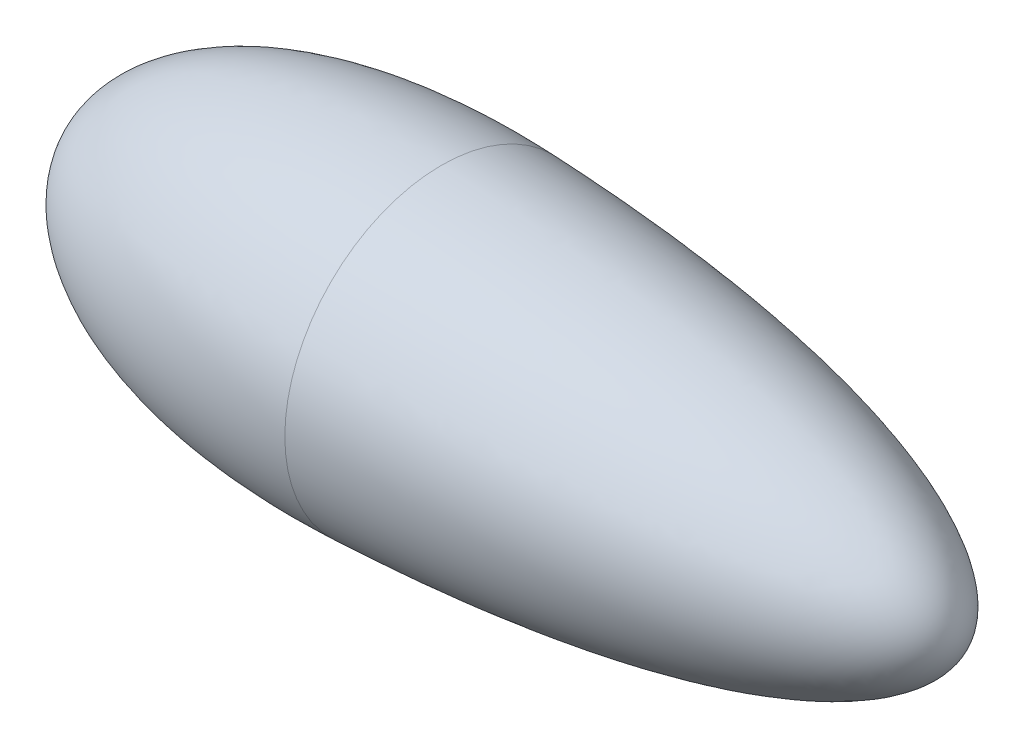
ISO-10303-21;
HEADER;
FILE_DESCRIPTION(('STEP AP214'),'2;1');
FILE_NAME('part.step','',(''),(''),'','','');
FILE_SCHEMA(('AUTOMOTIVE_DESIGN { 1 0 10303 214 1 1 1 1 }'));
ENDSEC;
DATA;
#1=APPLICATION_CONTEXT('core data for automotive mechanical design processes');
#2=APPLICATION_PROTOCOL_DEFINITION('international standard','automotive_design',2000,#1);
#3=PRODUCT_CONTEXT('',#1,'mechanical');
#4=PRODUCT('Part','Part','',(#3));
#5=PRODUCT_RELATED_PRODUCT_CATEGORY('part','',(#4));
#6=PRODUCT_DEFINITION_FORMATION('','',#4);
#7=PRODUCT_DEFINITION_CONTEXT('part definition',#1,'design');
#8=PRODUCT_DEFINITION('design','',#6,#7);
#9=PRODUCT_DEFINITION_SHAPE('','',#8);
#10=(LENGTH_UNIT() NAMED_UNIT(*) SI_UNIT(.MILLI.,.METRE.));
#11=(NAMED_UNIT(*) PLANE_ANGLE_UNIT() SI_UNIT($,.RADIAN.));
#12=(NAMED_UNIT(*) SI_UNIT($,.STERADIAN.) SOLID_ANGLE_UNIT());
#13=UNCERTAINTY_MEASURE_WITH_UNIT(LENGTH_MEASURE(1.E-05),#10,'distance_accuracy_value','');
#14=(GEOMETRIC_REPRESENTATION_CONTEXT(3) GLOBAL_UNCERTAINTY_ASSIGNED_CONTEXT((#13)) GLOBAL_UNIT_ASSIGNED_CONTEXT((#10,
#11,#12)) REPRESENTATION_CONTEXT('',''));
#15=CARTESIAN_POINT('',(0.,0.,0.));
#16=DIRECTION('',(0.,0.,1.));
#17=DIRECTION('',(1.,0.,0.));
#18=AXIS2_PLACEMENT_3D('',#15,#16,#17);
#19=CARTESIAN_POINT('',(0.,0.,-228.6));
#20=CARTESIAN_POINT('',(-345.642195091356,0.,-242.004231658086));
#21=CARTESIAN_POINT('',(-518.463292637034,0.,-121.002115829043));
#22=CARTESIAN_POINT('',(-518.463292637034,0.,0.));
#23=B_SPLINE_CURVE_WITH_KNOTS('',3,(#19,#20,#21,#22),.UNSPECIFIED.,.F.,.F.,(4,4),(0.,1.),.UNSPECIFIED.);
#24=CARTESIAN_POINT('',(-518.463292637034,0.,0.));
#25=DIRECTION('',(-1.,0.,0.));
#26=AXIS1_PLACEMENT('',#24,#25);
#27=SURFACE_OF_REVOLUTION('',#23,#26);
#28=CARTESIAN_POINT('',(-518.463292637034,0.,0.));
#29=VERTEX_POINT('',#28);
#30=VERTEX_LOOP('',#29);
#31=FACE_BOUND('',#30,.T.);
#32=CARTESIAN_POINT('',(0.,0.,0.));
#33=DIRECTION('',(-1.,0.,0.));
#34=DIRECTION('',(0.,0.,1.));
#35=AXIS2_PLACEMENT_3D('',#32,#33,#34);
#36=CIRCLE('',#35,228.6);
#37=CARTESIAN_POINT('',(0.,0.,228.6));
#38=VERTEX_POINT('',#37);
#39=EDGE_CURVE('E11',#38,#38,#36,.T.);
#40=ORIENTED_EDGE('',*,*,#39,.T.);
#41=EDGE_LOOP('',(#40));
#42=FACE_BOUND('',#41,.T.);
#43=ADVANCED_FACE('F37',(#31,#42),#27,.T.);
#44=CARTESIAN_POINT('',(751.536707362966,0.,0.));
#45=CARTESIAN_POINT('',(750.629499746503,0.,-104.585345934528));
#46=CARTESIAN_POINT('',(500.117263958847,0.,-209.205123571385));
#47=CARTESIAN_POINT('',(0.,0.,-228.6));
#48=B_SPLINE_CURVE_WITH_KNOTS('',3,(#44,#45,#46,#47),.UNSPECIFIED.,.F.,.F.,(4,4),(0.,1.),.UNSPECIFIED.);
#49=CARTESIAN_POINT('',(-518.463292637034,0.,0.));
#50=DIRECTION('',(-1.,0.,0.));
#51=AXIS1_PLACEMENT('',#49,#50);
#52=SURFACE_OF_REVOLUTION('',#48,#51);
#53=ORIENTED_EDGE('',*,*,#39,.F.);
#54=EDGE_LOOP('',(#53));
#55=FACE_BOUND('',#54,.T.);
#56=CARTESIAN_POINT('',(751.536707362966,0.,0.));
#57=VERTEX_POINT('',#56);
#58=VERTEX_LOOP('',#57);
#59=FACE_BOUND('',#58,.T.);
#60=ADVANCED_FACE('F52',(#55,#59),#52,.T.);
#61=CLOSED_SHELL('',(#43,#60));
#62=MANIFOLD_SOLID_BREP('B2',#61);
#63=ADVANCED_BREP_SHAPE_REPRESENTATION('',(#18,#62),#14);
#64=SHAPE_DEFINITION_REPRESENTATION(#9,#63);
ENDSEC;
END-ISO-10303-21;
